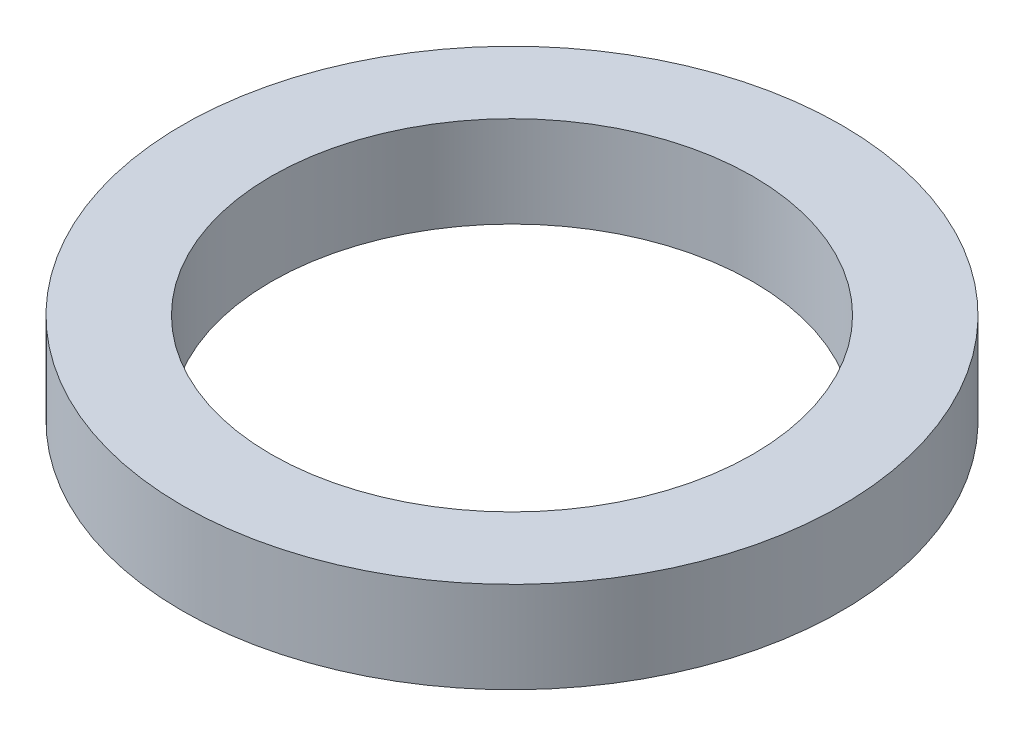
ISO-10303-21;
HEADER;
FILE_DESCRIPTION(('STEP AP214'),'2;1');
FILE_NAME('part.step','',(''),(''),'','','');
FILE_SCHEMA(('AUTOMOTIVE_DESIGN { 1 0 10303 214 1 1 1 1 }'));
ENDSEC;
DATA;
#1=APPLICATION_CONTEXT('core data for automotive mechanical design processes');
#2=APPLICATION_PROTOCOL_DEFINITION('international standard','automotive_design',2000,#1);
#3=PRODUCT_CONTEXT('',#1,'mechanical');
#4=PRODUCT('Part','Part','',(#3));
#5=PRODUCT_RELATED_PRODUCT_CATEGORY('part','',(#4));
#6=PRODUCT_DEFINITION_FORMATION('','',#4);
#7=PRODUCT_DEFINITION_CONTEXT('part definition',#1,'design');
#8=PRODUCT_DEFINITION('design','',#6,#7);
#9=PRODUCT_DEFINITION_SHAPE('','',#8);
#10=(LENGTH_UNIT() NAMED_UNIT(*) SI_UNIT(.MILLI.,.METRE.));
#11=(NAMED_UNIT(*) PLANE_ANGLE_UNIT() SI_UNIT($,.RADIAN.));
#12=(NAMED_UNIT(*) SI_UNIT($,.STERADIAN.) SOLID_ANGLE_UNIT());
#13=UNCERTAINTY_MEASURE_WITH_UNIT(LENGTH_MEASURE(1.E-05),#10,'distance_accuracy_value','');
#14=(GEOMETRIC_REPRESENTATION_CONTEXT(3) GLOBAL_UNCERTAINTY_ASSIGNED_CONTEXT((#13)) GLOBAL_UNIT_ASSIGNED_CONTEXT((#10,
#11,#12)) REPRESENTATION_CONTEXT('',''));
#15=CARTESIAN_POINT('',(0.,0.,0.));
#16=DIRECTION('',(0.,0.,1.));
#17=DIRECTION('',(1.,0.,0.));
#18=AXIS2_PLACEMENT_3D('',#15,#16,#17);
#19=CARTESIAN_POINT('',(0.,18.,0.));
#20=DIRECTION('',(0.,-1.,0.));
#21=DIRECTION('',(0.,0.,-1.));
#22=AXIS2_PLACEMENT_3D('',#19,#20,#21);
#23=CYLINDRICAL_SURFACE('',#22,65.);
#24=CARTESIAN_POINT('',(0.,18.,0.));
#25=DIRECTION('',(0.,1.,0.));
#26=DIRECTION('',(0.,0.,1.));
#27=AXIS2_PLACEMENT_3D('',#24,#25,#26);
#28=CIRCLE('',#27,65.);
#29=CARTESIAN_POINT('',(0.,18.,65.));
#30=VERTEX_POINT('',#29);
#31=EDGE_CURVE('E10',#30,#30,#28,.T.);
#32=ORIENTED_EDGE('',*,*,#31,.F.);
#33=EDGE_LOOP('',(#32));
#34=FACE_BOUND('',#33,.T.);
#35=CARTESIAN_POINT('',(0.,0.,0.));
#36=DIRECTION('',(0.,1.,0.));
#37=DIRECTION('',(0.,0.,1.));
#38=AXIS2_PLACEMENT_3D('',#35,#36,#37);
#39=CIRCLE('',#38,65.);
#40=CARTESIAN_POINT('',(0.,0.,65.));
#41=VERTEX_POINT('',#40);
#42=EDGE_CURVE('E37',#41,#41,#39,.T.);
#43=ORIENTED_EDGE('',*,*,#42,.T.);
#44=EDGE_LOOP('',(#43));
#45=FACE_BOUND('',#44,.T.);
#46=ADVANCED_FACE('F40',(#34,#45),#23,.T.);
#47=CARTESIAN_POINT('',(0.,18.,0.));
#48=DIRECTION('',(0.,1.,0.));
#49=DIRECTION('',(0.,0.,1.));
#50=AXIS2_PLACEMENT_3D('',#47,#48,#49);
#51=PLANE('',#50);
#52=CARTESIAN_POINT('',(0.,18.,0.));
#53=DIRECTION('',(0.,1.,0.));
#54=DIRECTION('',(0.,0.,1.));
#55=AXIS2_PLACEMENT_3D('',#52,#53,#54);
#56=CIRCLE('',#55,47.5);
#57=CARTESIAN_POINT('',(0.,18.,47.5));
#58=VERTEX_POINT('',#57);
#59=EDGE_CURVE('E50',#58,#58,#56,.T.);
#60=ORIENTED_EDGE('',*,*,#59,.F.);
#61=EDGE_LOOP('',(#60));
#62=FACE_BOUND('',#61,.T.);
#63=ORIENTED_EDGE('',*,*,#31,.T.);
#64=EDGE_LOOP('',(#63));
#65=FACE_BOUND('',#64,.T.);
#66=ADVANCED_FACE('F59',(#62,#65),#51,.T.);
#67=CARTESIAN_POINT('',(0.,0.,0.));
#68=DIRECTION('',(0.,1.,0.));
#69=DIRECTION('',(0.,0.,1.));
#70=AXIS2_PLACEMENT_3D('',#67,#68,#69);
#71=PLANE('',#70);
#72=CARTESIAN_POINT('',(0.,0.,0.));
#73=DIRECTION('',(0.,1.,0.));
#74=DIRECTION('',(0.,0.,1.));
#75=AXIS2_PLACEMENT_3D('',#72,#73,#74);
#76=CIRCLE('',#75,47.5);
#77=CARTESIAN_POINT('',(0.,0.,47.5));
#78=VERTEX_POINT('',#77);
#79=EDGE_CURVE('E47',#78,#78,#76,.T.);
#80=ORIENTED_EDGE('',*,*,#79,.T.);
#81=EDGE_LOOP('',(#80));
#82=FACE_BOUND('',#81,.T.);
#83=ORIENTED_EDGE('',*,*,#42,.F.);
#84=EDGE_LOOP('',(#83));
#85=FACE_BOUND('',#84,.T.);
#86=ADVANCED_FACE('F58',(#82,#85),#71,.F.);
#87=CARTESIAN_POINT('',(0.,18.,0.));
#88=DIRECTION('',(0.,-1.,0.));
#89=DIRECTION('',(0.,0.,-1.));
#90=AXIS2_PLACEMENT_3D('',#87,#88,#89);
#91=CYLINDRICAL_SURFACE('',#90,47.5);
#92=ORIENTED_EDGE('',*,*,#59,.T.);
#93=EDGE_LOOP('',(#92));
#94=FACE_BOUND('',#93,.T.);
#95=ORIENTED_EDGE('',*,*,#79,.F.);
#96=EDGE_LOOP('',(#95));
#97=FACE_BOUND('',#96,.T.);
#98=ADVANCED_FACE('F54',(#94,#97),#91,.F.);
#99=CLOSED_SHELL('',(#46,#66,#86,#98));
#100=MANIFOLD_SOLID_BREP('B2',#99);
#101=ADVANCED_BREP_SHAPE_REPRESENTATION('',(#18,#100),#14);
#102=SHAPE_DEFINITION_REPRESENTATION(#9,#101);
ENDSEC;
END-ISO-10303-21;
